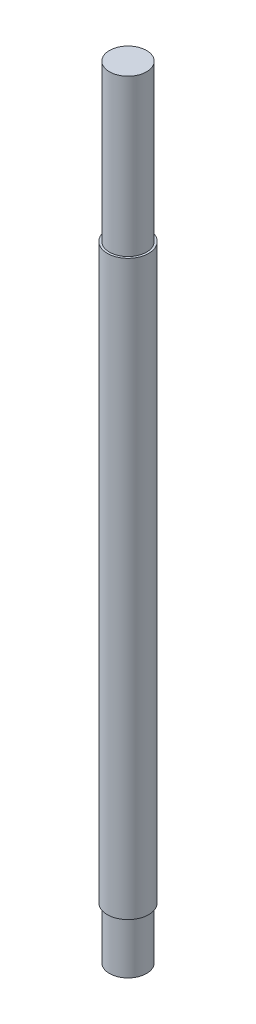
ISO-10303-21;
HEADER;
FILE_DESCRIPTION(('STEP AP214'),'2;1');
FILE_NAME('part.step','',(''),(''),'','','');
FILE_SCHEMA(('AUTOMOTIVE_DESIGN { 1 0 10303 214 1 1 1 1 }'));
ENDSEC;
DATA;
#1=APPLICATION_CONTEXT('core data for automotive mechanical design processes');
#2=APPLICATION_PROTOCOL_DEFINITION('international standard','automotive_design',2000,#1);
#3=PRODUCT_CONTEXT('',#1,'mechanical');
#4=PRODUCT('Part','Part','',(#3));
#5=PRODUCT_RELATED_PRODUCT_CATEGORY('part','',(#4));
#6=PRODUCT_DEFINITION_FORMATION('','',#4);
#7=PRODUCT_DEFINITION_CONTEXT('part definition',#1,'design');
#8=PRODUCT_DEFINITION('design','',#6,#7);
#9=PRODUCT_DEFINITION_SHAPE('','',#8);
#10=(LENGTH_UNIT() NAMED_UNIT(*) SI_UNIT(.MILLI.,.METRE.));
#11=(NAMED_UNIT(*) PLANE_ANGLE_UNIT() SI_UNIT($,.RADIAN.));
#12=(NAMED_UNIT(*) SI_UNIT($,.STERADIAN.) SOLID_ANGLE_UNIT());
#13=UNCERTAINTY_MEASURE_WITH_UNIT(LENGTH_MEASURE(1.E-05),#10,'distance_accuracy_value','');
#14=(GEOMETRIC_REPRESENTATION_CONTEXT(3) GLOBAL_UNCERTAINTY_ASSIGNED_CONTEXT((#13)) GLOBAL_UNIT_ASSIGNED_CONTEXT((#10,
#11,#12)) REPRESENTATION_CONTEXT('',''));
#15=CARTESIAN_POINT('',(0.,0.,0.));
#16=DIRECTION('',(0.,0.,1.));
#17=DIRECTION('',(1.,0.,0.));
#18=AXIS2_PLACEMENT_3D('',#15,#16,#17);
#19=CARTESIAN_POINT('',(0.,60.,0.));
#20=DIRECTION('',(0.,-1.,0.));
#21=DIRECTION('',(0.,0.,-1.));
#22=AXIS2_PLACEMENT_3D('',#19,#20,#21);
#23=CYLINDRICAL_SURFACE('',#22,1.5875);
#24=CARTESIAN_POINT('',(0.,4.,0.));
#25=DIRECTION('',(0.,-1.,0.));
#26=DIRECTION('',(0.,0.,-1.));
#27=AXIS2_PLACEMENT_3D('',#24,#25,#26);
#28=CIRCLE('',#27,1.5875);
#29=CARTESIAN_POINT('',(0.,4.,-1.5875));
#30=VERTEX_POINT('',#29);
#31=EDGE_CURVE('E10',#30,#30,#28,.T.);
#32=ORIENTED_EDGE('',*,*,#31,.F.);
#33=EDGE_LOOP('',(#32));
#34=FACE_BOUND('',#33,.T.);
#35=CARTESIAN_POINT('',(0.,48.,0.));
#36=DIRECTION('',(0.,1.,0.));
#37=DIRECTION('',(0.,0.,1.));
#38=AXIS2_PLACEMENT_3D('',#35,#36,#37);
#39=CIRCLE('',#38,1.5875);
#40=CARTESIAN_POINT('',(0.,48.,1.5875));
#41=VERTEX_POINT('',#40);
#42=EDGE_CURVE('E49',#41,#41,#39,.T.);
#43=ORIENTED_EDGE('',*,*,#42,.F.);
#44=EDGE_LOOP('',(#43));
#45=FACE_BOUND('',#44,.T.);
#46=ADVANCED_FACE('F34',(#34,#45),#23,.T.);
#47=CARTESIAN_POINT('',(0.,4.,0.));
#48=DIRECTION('',(0.,-1.,0.));
#49=DIRECTION('',(0.,0.,-1.));
#50=AXIS2_PLACEMENT_3D('',#47,#48,#49);
#51=PLANE('',#50);
#52=CARTESIAN_POINT('',(0.,4.,0.));
#53=DIRECTION('',(0.,-1.,0.));
#54=DIRECTION('',(0.,0.,-1.));
#55=AXIS2_PLACEMENT_3D('',#52,#53,#54);
#56=CIRCLE('',#55,1.4224);
#57=CARTESIAN_POINT('',(0.,4.,-1.4224));
#58=VERTEX_POINT('',#57);
#59=EDGE_CURVE('E40',#58,#58,#56,.T.);
#60=ORIENTED_EDGE('',*,*,#59,.F.);
#61=EDGE_LOOP('',(#60));
#62=FACE_BOUND('',#61,.T.);
#63=ORIENTED_EDGE('',*,*,#31,.T.);
#64=EDGE_LOOP('',(#63));
#65=FACE_BOUND('',#64,.T.);
#66=ADVANCED_FACE('F71',(#62,#65),#51,.T.);
#67=CARTESIAN_POINT('',(0.,4.,0.));
#68=DIRECTION('',(0.,-1.,0.));
#69=DIRECTION('',(0.,0.,-1.));
#70=AXIS2_PLACEMENT_3D('',#67,#68,#69);
#71=CYLINDRICAL_SURFACE('',#70,1.4224);
#72=ORIENTED_EDGE('',*,*,#59,.T.);
#73=EDGE_LOOP('',(#72));
#74=FACE_BOUND('',#73,.T.);
#75=CARTESIAN_POINT('',(0.,0.,0.));
#76=DIRECTION('',(0.,-1.,0.));
#77=DIRECTION('',(0.,0.,-1.));
#78=AXIS2_PLACEMENT_3D('',#75,#76,#77);
#79=CIRCLE('',#78,1.4224);
#80=CARTESIAN_POINT('',(0.,0.,-1.4224));
#81=VERTEX_POINT('',#80);
#82=EDGE_CURVE('E44',#81,#81,#79,.T.);
#83=ORIENTED_EDGE('',*,*,#82,.F.);
#84=EDGE_LOOP('',(#83));
#85=FACE_BOUND('',#84,.T.);
#86=ADVANCED_FACE('F76',(#74,#85),#71,.T.);
#87=CARTESIAN_POINT('',(0.,0.,0.));
#88=DIRECTION('',(0.,1.,0.));
#89=DIRECTION('',(0.,0.,1.));
#90=AXIS2_PLACEMENT_3D('',#87,#88,#89);
#91=PLANE('',#90);
#92=ORIENTED_EDGE('',*,*,#82,.T.);
#93=EDGE_LOOP('',(#92));
#94=FACE_BOUND('',#93,.T.);
#95=ADVANCED_FACE('F66',(#94),#91,.F.);
#96=CARTESIAN_POINT('',(0.,48.,0.));
#97=DIRECTION('',(0.,1.,0.));
#98=DIRECTION('',(0.,0.,1.));
#99=AXIS2_PLACEMENT_3D('',#96,#97,#98);
#100=PLANE('',#99);
#101=CARTESIAN_POINT('',(0.,48.,0.));
#102=DIRECTION('',(0.,1.,0.));
#103=DIRECTION('',(0.,0.,1.));
#104=AXIS2_PLACEMENT_3D('',#101,#102,#103);
#105=CIRCLE('',#104,1.4224);
#106=CARTESIAN_POINT('',(0.,48.,1.4224));
#107=VERTEX_POINT('',#106);
#108=EDGE_CURVE('E53',#107,#107,#105,.T.);
#109=ORIENTED_EDGE('',*,*,#108,.F.);
#110=EDGE_LOOP('',(#109));
#111=FACE_BOUND('',#110,.T.);
#112=ORIENTED_EDGE('',*,*,#42,.T.);
#113=EDGE_LOOP('',(#112));
#114=FACE_BOUND('',#113,.T.);
#115=ADVANCED_FACE('F63',(#111,#114),#100,.T.);
#116=CARTESIAN_POINT('',(0.,48.,0.));
#117=DIRECTION('',(0.,1.,0.));
#118=DIRECTION('',(0.,0.,1.));
#119=AXIS2_PLACEMENT_3D('',#116,#117,#118);
#120=CYLINDRICAL_SURFACE('',#119,1.4224);
#121=ORIENTED_EDGE('',*,*,#108,.T.);
#122=EDGE_LOOP('',(#121));
#123=FACE_BOUND('',#122,.T.);
#124=CARTESIAN_POINT('',(0.,60.,0.));
#125=DIRECTION('',(0.,1.,0.));
#126=DIRECTION('',(0.,0.,1.));
#127=AXIS2_PLACEMENT_3D('',#124,#125,#126);
#128=CIRCLE('',#127,1.4224);
#129=CARTESIAN_POINT('',(0.,60.,1.4224));
#130=VERTEX_POINT('',#129);
#131=EDGE_CURVE('E54',#130,#130,#128,.T.);
#132=ORIENTED_EDGE('',*,*,#131,.F.);
#133=EDGE_LOOP('',(#132));
#134=FACE_BOUND('',#133,.T.);
#135=ADVANCED_FACE('F60',(#123,#134),#120,.T.);
#136=CARTESIAN_POINT('',(0.,60.,0.));
#137=DIRECTION('',(0.,1.,0.));
#138=DIRECTION('',(0.,0.,1.));
#139=AXIS2_PLACEMENT_3D('',#136,#137,#138);
#140=PLANE('',#139);
#141=ORIENTED_EDGE('',*,*,#131,.T.);
#142=EDGE_LOOP('',(#141));
#143=FACE_BOUND('',#142,.T.);
#144=ADVANCED_FACE('F84',(#143),#140,.T.);
#145=CLOSED_SHELL('',(#46,#66,#86,#95,#115,#135,#144));
#146=MANIFOLD_SOLID_BREP('B2',#145);
#147=ADVANCED_BREP_SHAPE_REPRESENTATION('',(#18,#146),#14);
#148=SHAPE_DEFINITION_REPRESENTATION(#9,#147);
ENDSEC;
END-ISO-10303-21;
